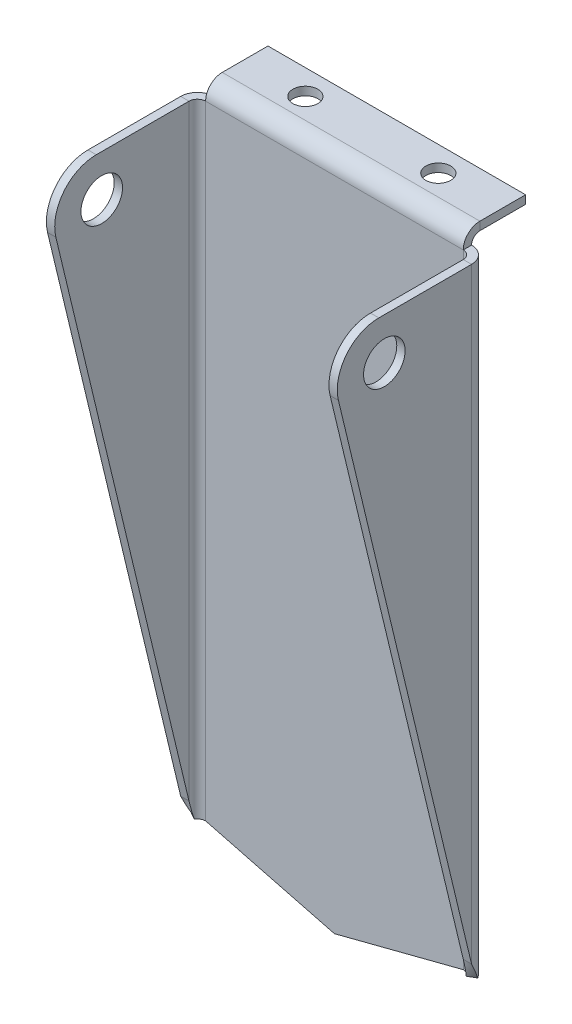
ISO-10303-21;
HEADER;
FILE_DESCRIPTION(('STEP AP214'),'2;1');
FILE_NAME('part.step','',(''),(''),'','','');
FILE_SCHEMA(('AUTOMOTIVE_DESIGN { 1 0 10303 214 1 1 1 1 }'));
ENDSEC;
DATA;
#1=APPLICATION_CONTEXT('core data for automotive mechanical design processes');
#2=APPLICATION_PROTOCOL_DEFINITION('international standard','automotive_design',2000,#1);
#3=PRODUCT_CONTEXT('',#1,'mechanical');
#4=PRODUCT('Part','Part','',(#3));
#5=PRODUCT_RELATED_PRODUCT_CATEGORY('part','',(#4));
#6=PRODUCT_DEFINITION_FORMATION('','',#4);
#7=PRODUCT_DEFINITION_CONTEXT('part definition',#1,'design');
#8=PRODUCT_DEFINITION('design','',#6,#7);
#9=PRODUCT_DEFINITION_SHAPE('','',#8);
#10=(LENGTH_UNIT() NAMED_UNIT(*) SI_UNIT(.MILLI.,.METRE.));
#11=(NAMED_UNIT(*) PLANE_ANGLE_UNIT() SI_UNIT($,.RADIAN.));
#12=(NAMED_UNIT(*) SI_UNIT($,.STERADIAN.) SOLID_ANGLE_UNIT());
#13=UNCERTAINTY_MEASURE_WITH_UNIT(LENGTH_MEASURE(1.E-05),#10,'distance_accuracy_value','');
#14=(GEOMETRIC_REPRESENTATION_CONTEXT(3) GLOBAL_UNCERTAINTY_ASSIGNED_CONTEXT((#13)) GLOBAL_UNIT_ASSIGNED_CONTEXT((#10,
#11,#12)) REPRESENTATION_CONTEXT('',''));
#15=CARTESIAN_POINT('',(0.,0.,0.));
#16=DIRECTION('',(0.,0.,1.));
#17=DIRECTION('',(1.,0.,0.));
#18=AXIS2_PLACEMENT_3D('',#15,#16,#17);
#19=CARTESIAN_POINT('',(-34.9999999999999,-10.0000000000015,-8.68396810574605));
#20=DIRECTION('',(0.999999999999998,0.,0.));
#21=DIRECTION('',(0.,1.,0.));
#22=AXIS2_PLACEMENT_3D('',#19,#20,#21);
#23=CYLINDRICAL_SURFACE('',#22,10.);
#24=DIRECTION('',(-0.999999999999998,0.,0.));
#25=VECTOR('',#24,1.);
#26=CARTESIAN_POINT('',(-34.9999999999999,-12.3337295247532,1.03990491405922));
#27=LINE('',#26,#25);
#28=CARTESIAN_POINT('',(-32.9999999999999,-12.3337295247519,1.03990491405907));
#29=VERTEX_POINT('',#28);
#30=CARTESIAN_POINT('',(-34.9999999999999,-12.3337295247532,1.03990491405922));
#31=VERTEX_POINT('',#30);
#32=EDGE_CURVE('E11',#29,#31,#27,.T.);
#33=ORIENTED_EDGE('',*,*,#32,.F.);
#34=CARTESIAN_POINT('',(-32.9999999999999,-10.0000000000015,-8.68396810574605));
#35=DIRECTION('',(0.999999999999998,0.,0.));
#36=DIRECTION('',(0.,1.,0.));
#37=AXIS2_PLACEMENT_3D('',#34,#35,#36);
#38=CIRCLE('',#37,10.);
#39=CARTESIAN_POINT('',(-32.9999999999999,7.24398594486813E-13,-8.68396810574624));
#40=VERTEX_POINT('',#39);
#41=EDGE_CURVE('E152',#40,#29,#38,.T.);
#42=ORIENTED_EDGE('',*,*,#41,.F.);
#43=DIRECTION('',(-0.999999999999998,0.,0.));
#44=VECTOR('',#43,1.);
#45=CARTESIAN_POINT('',(-34.9999999999999,-6.66133814775094E-13,-8.68396810574604));
#46=LINE('',#45,#44);
#47=CARTESIAN_POINT('',(-34.9999999999999,-6.66133814775094E-13,-8.68396810574604));
#48=VERTEX_POINT('',#47);
#49=EDGE_CURVE('E47',#40,#48,#46,.T.);
#50=ORIENTED_EDGE('',*,*,#49,.T.);
#51=CARTESIAN_POINT('',(-34.9999999999999,-10.0000000000015,-8.68396810574605));
#52=DIRECTION('',(0.999999999999998,0.,0.));
#53=DIRECTION('',(0.,1.,0.));
#54=AXIS2_PLACEMENT_3D('',#51,#52,#53);
#55=CIRCLE('',#54,10.);
#56=EDGE_CURVE('E267',#48,#31,#55,.T.);
#57=ORIENTED_EDGE('',*,*,#56,.T.);
#58=EDGE_LOOP('',(#33,#42,#50,#57));
#59=FACE_BOUND('',#58,.T.);
#60=ADVANCED_FACE('F37',(#59),#23,.T.);
#61=CARTESIAN_POINT('',(-34.9999999999999,0.,31.0000005295282));
#62=DIRECTION('',(0.,1.,0.));
#63=DIRECTION('',(0.,0.,1.));
#64=AXIS2_PLACEMENT_3D('',#61,#62,#63);
#65=PLANE('',#64);
#66=ORIENTED_EDGE('',*,*,#49,.F.);
#67=DIRECTION('',(0.,0.,1.));
#68=VECTOR('',#67,1.);
#69=CARTESIAN_POINT('',(-32.9999999999999,7.21644966006352E-13,31.0000005295281));
#70=LINE('',#69,#68);
#71=CARTESIAN_POINT('',(-32.9999999999999,0.,-31.0000010590563));
#72=VERTEX_POINT('',#71);
#73=EDGE_CURVE('E149',#40,#72,#70,.F.);
#74=ORIENTED_EDGE('',*,*,#73,.T.);
#75=DIRECTION('',(-0.999999999999965,-3.46944695195362E-13,-2.64763984174355E-07));
#76=VECTOR('',#75,1.);
#77=CARTESIAN_POINT('',(-34.9999999999998,-1.33226762955019E-12,-31.000001059056));
#78=LINE('',#77,#76);
#79=CARTESIAN_POINT('',(-34.9999999999998,-1.33226762955019E-12,-31.000001059056));
#80=VERTEX_POINT('',#79);
#81=EDGE_CURVE('E263',#72,#80,#78,.T.);
#82=ORIENTED_EDGE('',*,*,#81,.T.);
#83=DIRECTION('',(0.,0.,1.));
#84=VECTOR('',#83,1.);
#85=CARTESIAN_POINT('',(-34.9999999999999,0.,31.0000005295282));
#86=LINE('',#85,#84);
#87=EDGE_CURVE('E274',#48,#80,#86,.F.);
#88=ORIENTED_EDGE('',*,*,#87,.F.);
#89=EDGE_LOOP('',(#66,#74,#82,#88));
#90=FACE_BOUND('',#89,.T.);
#91=ADVANCED_FACE('F278',(#90),#65,.T.);
#92=CARTESIAN_POINT('',(-30.9999999999999,-7.7715611723761E-13,-31.0000000000001));
#93=DIRECTION('',(0.,-1.,0.));
#94=DIRECTION('',(1.,0.,0.));
#95=AXIS2_PLACEMENT_3D('',#92,#93,#94);
#96=PLANE('',#95);
#97=ORIENTED_EDGE('',*,*,#81,.F.);
#98=CARTESIAN_POINT('',(-30.9999999999999,0.,-31.));
#99=DIRECTION('',(0.,1.,0.));
#100=DIRECTION('',(-1.,0.,0.));
#101=AXIS2_PLACEMENT_3D('',#98,#99,#100);
#102=CIRCLE('',#101,2.00000000000007);
#103=CARTESIAN_POINT('',(-30.9999999999997,1.01298009994998E-12,-33.));
#104=VERTEX_POINT('',#103);
#105=EDGE_CURVE('E145',#72,#104,#102,.F.);
#106=ORIENTED_EDGE('',*,*,#105,.T.);
#107=DIRECTION('',(1.38777878078145E-13,0.,-1.));
#108=VECTOR('',#107,1.);
#109=CARTESIAN_POINT('',(-30.9999999999999,8.88178419700125E-13,-35.));
#110=LINE('',#109,#108);
#111=CARTESIAN_POINT('',(-30.9999999999999,8.88178419700125E-13,-35.));
#112=VERTEX_POINT('',#111);
#113=EDGE_CURVE('E260',#104,#112,#110,.T.);
#114=ORIENTED_EDGE('',*,*,#113,.T.);
#115=CARTESIAN_POINT('',(-30.9999999999999,-7.7715611723761E-13,-31.0000000000001));
#116=DIRECTION('',(0.,1.,0.));
#117=DIRECTION('',(-0.999999999999998,0.,0.));
#118=AXIS2_PLACEMENT_3D('',#115,#116,#117);
#119=CIRCLE('',#118,4.00000000000006);
#120=EDGE_CURVE('E291',#80,#112,#119,.F.);
#121=ORIENTED_EDGE('',*,*,#120,.F.);
#122=EDGE_LOOP('',(#97,#106,#114,#121));
#123=FACE_BOUND('',#122,.T.);
#124=ADVANCED_FACE('F483',(#123),#96,.F.);
#125=CARTESIAN_POINT('',(-30.9999999999999,7.7715611723761E-13,-37.));
#126=DIRECTION('',(-0.999999999999998,0.,0.));
#127=DIRECTION('',(0.,-1.,0.));
#128=AXIS2_PLACEMENT_3D('',#125,#126,#127);
#129=PLANE('',#128);
#130=ORIENTED_EDGE('',*,*,#113,.F.);
#131=CARTESIAN_POINT('',(-30.9999999999997,7.63712146166722E-13,-37.));
#132=DIRECTION('',(0.999999999999998,0.,0.));
#133=DIRECTION('',(0.,1.,0.));
#134=AXIS2_PLACEMENT_3D('',#131,#132,#133);
#135=CIRCLE('',#134,4.);
#136=CARTESIAN_POINT('',(-31.0000000000004,4.00000000000146,-37.0000000000002));
#137=VERTEX_POINT('',#136);
#138=EDGE_CURVE('E196',#104,#137,#135,.F.);
#139=ORIENTED_EDGE('',*,*,#138,.T.);
#140=DIRECTION('',(0.,-1.,0.));
#141=VECTOR('',#140,1.);
#142=CARTESIAN_POINT('',(-30.9999999999999,2.00000000000011,-37.));
#143=LINE('',#142,#141);
#144=CARTESIAN_POINT('',(-30.9999999999999,2.00000000000011,-37.));
#145=VERTEX_POINT('',#144);
#146=EDGE_CURVE('E257',#137,#145,#143,.T.);
#147=ORIENTED_EDGE('',*,*,#146,.T.);
#148=CARTESIAN_POINT('',(-30.9999999999999,7.7715611723761E-13,-37.));
#149=DIRECTION('',(0.999999999999998,0.,0.));
#150=DIRECTION('',(0.,1.,0.));
#151=AXIS2_PLACEMENT_3D('',#148,#149,#150);
#152=CIRCLE('',#151,2.00000000000001);
#153=EDGE_CURVE('E355',#112,#145,#152,.F.);
#154=ORIENTED_EDGE('',*,*,#153,.F.);
#155=EDGE_LOOP('',(#130,#139,#147,#154));
#156=FACE_BOUND('',#155,.T.);
#157=ADVANCED_FACE('F451',(#156),#129,.T.);
#158=CARTESIAN_POINT('',(-30.9999999999999,1.99999999999845,-35.0000000000002));
#159=DIRECTION('',(1.,0.,0.));
#160=DIRECTION('',(0.,0.,1.));
#161=AXIS2_PLACEMENT_3D('',#158,#159,#160);
#162=PLANE('',#161);
#163=ORIENTED_EDGE('',*,*,#146,.F.);
#164=DIRECTION('',(0.,0.,-1.));
#165=VECTOR('',#164,1.);
#166=CARTESIAN_POINT('',(-31.0000000000004,4.00000000000133,0.));
#167=LINE('',#166,#165);
#168=CARTESIAN_POINT('',(-31.0000000000004,4.0000000000015,-48.0000000000004));
#169=VERTEX_POINT('',#168);
#170=EDGE_CURVE('E205',#169,#137,#167,.F.);
#171=ORIENTED_EDGE('',*,*,#170,.F.);
#172=DIRECTION('',(0.,-1.,0.));
#173=VECTOR('',#172,1.);
#174=CARTESIAN_POINT('',(-30.9999999999999,2.00000000000011,-48.0000000000001));
#175=LINE('',#174,#173);
#176=CARTESIAN_POINT('',(-30.9999999999999,2.00000000000011,-48.0000000000001));
#177=VERTEX_POINT('',#176);
#178=EDGE_CURVE('E254',#169,#177,#175,.T.);
#179=ORIENTED_EDGE('',*,*,#178,.T.);
#180=DIRECTION('',(0.,0.,1.));
#181=VECTOR('',#180,1.);
#182=CARTESIAN_POINT('',(-30.9999999999999,1.99999999999845,-35.0000000000002));
#183=LINE('',#182,#181);
#184=EDGE_CURVE('E347',#177,#145,#183,.T.);
#185=ORIENTED_EDGE('',*,*,#184,.T.);
#186=EDGE_LOOP('',(#163,#171,#179,#185));
#187=FACE_BOUND('',#186,.T.);
#188=ADVANCED_FACE('F345',(#187),#162,.F.);
#189=CARTESIAN_POINT('',(-30.9999999999999,2.00000000000011,-48.0000000000001));
#190=DIRECTION('',(0.,0.,1.));
#191=DIRECTION('',(-0.999999999999998,0.,0.));
#192=AXIS2_PLACEMENT_3D('',#189,#190,#191);
#193=PLANE('',#192);
#194=ORIENTED_EDGE('',*,*,#178,.F.);
#195=DIRECTION('',(1.00000000000001,0.,0.));
#196=VECTOR('',#195,1.);
#197=CARTESIAN_POINT('',(0.,4.0000000000015,-48.0000000000004));
#198=LINE('',#197,#196);
#199=CARTESIAN_POINT('',(31.0000000000004,4.0000000000015,-48.0000000000004));
#200=VERTEX_POINT('',#199);
#201=EDGE_CURVE('E202',#200,#169,#198,.F.);
#202=ORIENTED_EDGE('',*,*,#201,.F.);
#203=DIRECTION('',(0.,-1.,0.));
#204=VECTOR('',#203,1.);
#205=CARTESIAN_POINT('',(30.9999999999999,2.00000000000011,-48.0000000000001));
#206=LINE('',#205,#204);
#207=CARTESIAN_POINT('',(30.9999999999999,2.00000000000011,-48.0000000000001));
#208=VERTEX_POINT('',#207);
#209=EDGE_CURVE('E251',#200,#208,#206,.T.);
#210=ORIENTED_EDGE('',*,*,#209,.T.);
#211=DIRECTION('',(-0.999999999999998,0.,0.));
#212=VECTOR('',#211,1.);
#213=CARTESIAN_POINT('',(-30.9999999999999,2.00000000000011,-48.0000000000001));
#214=LINE('',#213,#212);
#215=EDGE_CURVE('E341',#208,#177,#214,.T.);
#216=ORIENTED_EDGE('',*,*,#215,.T.);
#217=EDGE_LOOP('',(#194,#202,#210,#216));
#218=FACE_BOUND('',#217,.T.);
#219=ADVANCED_FACE('F336',(#218),#193,.F.);
#220=CARTESIAN_POINT('',(30.9999999999999,2.00000000000011,-48.0000000000001));
#221=DIRECTION('',(-1.,0.,0.));
#222=DIRECTION('',(0.,0.,-1.));
#223=AXIS2_PLACEMENT_3D('',#220,#221,#222);
#224=PLANE('',#223);
#225=ORIENTED_EDGE('',*,*,#209,.F.);
#226=DIRECTION('',(0.,0.,-1.));
#227=VECTOR('',#226,1.);
#228=CARTESIAN_POINT('',(31.0000000000004,4.00000000000133,0.));
#229=LINE('',#228,#227);
#230=CARTESIAN_POINT('',(31.0000000000004,4.00000000000146,-37.0000000000002));
#231=VERTEX_POINT('',#230);
#232=EDGE_CURVE('E197',#231,#200,#229,.T.);
#233=ORIENTED_EDGE('',*,*,#232,.F.);
#234=DIRECTION('',(0.,-1.,0.));
#235=VECTOR('',#234,1.);
#236=CARTESIAN_POINT('',(30.9999999999999,2.00000000000011,-37.));
#237=LINE('',#236,#235);
#238=CARTESIAN_POINT('',(30.9999999999999,2.00000000000011,-37.));
#239=VERTEX_POINT('',#238);
#240=EDGE_CURVE('E248',#231,#239,#237,.T.);
#241=ORIENTED_EDGE('',*,*,#240,.T.);
#242=DIRECTION('',(0.,0.,-1.));
#243=VECTOR('',#242,1.);
#244=CARTESIAN_POINT('',(30.9999999999999,2.00000000000011,-48.0000000000001));
#245=LINE('',#244,#243);
#246=EDGE_CURVE('E357',#239,#208,#245,.T.);
#247=ORIENTED_EDGE('',*,*,#246,.T.);
#248=EDGE_LOOP('',(#225,#233,#241,#247));
#249=FACE_BOUND('',#248,.T.);
#250=ADVANCED_FACE('F327',(#249),#224,.F.);
#251=CARTESIAN_POINT('',(30.9999999999999,7.7715611723761E-13,-37.));
#252=DIRECTION('',(-0.999999999999998,0.,0.));
#253=DIRECTION('',(0.,-1.,0.));
#254=AXIS2_PLACEMENT_3D('',#251,#252,#253);
#255=PLANE('',#254);
#256=ORIENTED_EDGE('',*,*,#240,.F.);
#257=CARTESIAN_POINT('',(30.9999999999999,7.7715611723761E-13,-37.));
#258=DIRECTION('',(0.999999999999998,0.,0.));
#259=DIRECTION('',(0.,1.,0.));
#260=AXIS2_PLACEMENT_3D('',#257,#258,#259);
#261=CIRCLE('',#260,4.);
#262=CARTESIAN_POINT('',(30.9999999999997,9.43689570931383E-13,-33.));
#263=VERTEX_POINT('',#262);
#264=EDGE_CURVE('E193',#231,#263,#261,.T.);
#265=ORIENTED_EDGE('',*,*,#264,.T.);
#266=DIRECTION('',(0.,-3.46944695195364E-13,-1.));
#267=VECTOR('',#266,1.);
#268=CARTESIAN_POINT('',(30.9999999999999,8.88178419700125E-13,-35.));
#269=LINE('',#268,#267);
#270=CARTESIAN_POINT('',(30.9999999999999,8.88178419700125E-13,-35.));
#271=VERTEX_POINT('',#270);
#272=EDGE_CURVE('E245',#263,#271,#269,.T.);
#273=ORIENTED_EDGE('',*,*,#272,.T.);
#274=CARTESIAN_POINT('',(30.9999999999999,7.7715611723761E-13,-37.));
#275=DIRECTION('',(0.999999999999998,0.,0.));
#276=DIRECTION('',(0.,1.,0.));
#277=AXIS2_PLACEMENT_3D('',#274,#275,#276);
#278=CIRCLE('',#277,2.00000000000001);
#279=EDGE_CURVE('E363',#239,#271,#278,.T.);
#280=ORIENTED_EDGE('',*,*,#279,.F.);
#281=EDGE_LOOP('',(#256,#265,#273,#280));
#282=FACE_BOUND('',#281,.T.);
#283=ADVANCED_FACE('F318',(#282),#255,.F.);
#284=CARTESIAN_POINT('',(30.9999999999999,-7.7715611723761E-13,-31.0000000000001));
#285=DIRECTION('',(0.,-1.,0.));
#286=DIRECTION('',(1.,0.,0.));
#287=AXIS2_PLACEMENT_3D('',#284,#285,#286);
#288=PLANE('',#287);
#289=ORIENTED_EDGE('',*,*,#272,.F.);
#290=CARTESIAN_POINT('',(30.9999999999999,2.27595720048157E-12,-31.));
#291=DIRECTION('',(0.,1.,0.));
#292=DIRECTION('',(-1.,0.,0.));
#293=AXIS2_PLACEMENT_3D('',#290,#291,#292);
#294=CIRCLE('',#293,2.00000000000005);
#295=CARTESIAN_POINT('',(32.9999999999999,1.39208089507535E-12,-31.0000005295284));
#296=VERTEX_POINT('',#295);
#297=EDGE_CURVE('E176',#263,#296,#294,.F.);
#298=ORIENTED_EDGE('',*,*,#297,.T.);
#299=DIRECTION('',(0.999999999999998,0.,0.));
#300=VECTOR('',#299,1.);
#301=CARTESIAN_POINT('',(34.9999999999999,0.,-31.0000005295281));
#302=LINE('',#301,#300);
#303=CARTESIAN_POINT('',(34.9999999999999,0.,-31.0000005295281));
#304=VERTEX_POINT('',#303);
#305=EDGE_CURVE('E242',#296,#304,#302,.T.);
#306=ORIENTED_EDGE('',*,*,#305,.T.);
#307=CARTESIAN_POINT('',(30.9999999999999,-7.7715611723761E-13,-31.0000000000001));
#308=DIRECTION('',(0.,1.,0.));
#309=DIRECTION('',(-0.999999999999998,0.,0.));
#310=AXIS2_PLACEMENT_3D('',#307,#308,#309);
#311=CIRCLE('',#310,4.00000000000004);
#312=EDGE_CURVE('E285',#271,#304,#311,.F.);
#313=ORIENTED_EDGE('',*,*,#312,.F.);
#314=EDGE_LOOP('',(#289,#298,#306,#313));
#315=FACE_BOUND('',#314,.T.);
#316=ADVANCED_FACE('F553',(#315),#288,.F.);
#317=CARTESIAN_POINT('',(34.9999999999999,0.,31.0000005295282));
#318=DIRECTION('',(0.,-1.,0.));
#319=DIRECTION('',(0.,0.,1.));
#320=AXIS2_PLACEMENT_3D('',#317,#318,#319);
#321=PLANE('',#320);
#322=ORIENTED_EDGE('',*,*,#305,.F.);
#323=DIRECTION('',(0.,0.,1.));
#324=VECTOR('',#323,1.);
#325=CARTESIAN_POINT('',(32.9999999999999,1.38777878078145E-12,31.0000005295282));
#326=LINE('',#325,#324);
#327=CARTESIAN_POINT('',(32.9999999999999,7.24398594486813E-13,-8.68396810574624));
#328=VERTEX_POINT('',#327);
#329=EDGE_CURVE('E187',#296,#328,#326,.T.);
#330=ORIENTED_EDGE('',*,*,#329,.T.);
#331=DIRECTION('',(0.999999999999998,0.,0.));
#332=VECTOR('',#331,1.);
#333=CARTESIAN_POINT('',(34.9999999999999,-6.66133814775094E-13,-8.68396810574604));
#334=LINE('',#333,#332);
#335=CARTESIAN_POINT('',(34.9999999999999,-6.66133814775094E-13,-8.68396810574604));
#336=VERTEX_POINT('',#335);
#337=EDGE_CURVE('E239',#328,#336,#334,.T.);
#338=ORIENTED_EDGE('',*,*,#337,.T.);
#339=DIRECTION('',(0.,0.,1.));
#340=VECTOR('',#339,1.);
#341=CARTESIAN_POINT('',(34.9999999999999,0.,31.0000005295282));
#342=LINE('',#341,#340);
#343=EDGE_CURVE('E374',#304,#336,#342,.T.);
#344=ORIENTED_EDGE('',*,*,#343,.F.);
#345=EDGE_LOOP('',(#322,#330,#338,#344));
#346=FACE_BOUND('',#345,.T.);
#347=ADVANCED_FACE('F401',(#346),#321,.F.);
#348=CARTESIAN_POINT('',(34.9999999999999,-10.0000000000013,-8.68396810574602));
#349=DIRECTION('',(-0.999999999999998,0.,0.));
#350=DIRECTION('',(0.,-1.,0.));
#351=AXIS2_PLACEMENT_3D('',#348,#349,#350);
#352=CYLINDRICAL_SURFACE('',#351,10.);
#353=ORIENTED_EDGE('',*,*,#337,.F.);
#354=CARTESIAN_POINT('',(32.9999999999999,-10.0000000000013,-8.68396810574602));
#355=DIRECTION('',(-0.999999999999998,0.,0.));
#356=DIRECTION('',(0.,-1.,0.));
#357=AXIS2_PLACEMENT_3D('',#354,#355,#356);
#358=CIRCLE('',#357,10.);
#359=CARTESIAN_POINT('',(32.9999999999999,-12.3337295247519,1.03990491405907));
#360=VERTEX_POINT('',#359);
#361=EDGE_CURVE('E180',#360,#328,#358,.T.);
#362=ORIENTED_EDGE('',*,*,#361,.F.);
#363=DIRECTION('',(0.999999999999998,0.,0.));
#364=VECTOR('',#363,1.);
#365=CARTESIAN_POINT('',(34.9999999999999,-12.3337295247532,1.03990491405922));
#366=LINE('',#365,#364);
#367=CARTESIAN_POINT('',(34.9999999999999,-12.3337295247532,1.03990491405922));
#368=VERTEX_POINT('',#367);
#369=EDGE_CURVE('E236',#360,#368,#366,.T.);
#370=ORIENTED_EDGE('',*,*,#369,.T.);
#371=CARTESIAN_POINT('',(34.9999999999999,-10.0000000000013,-8.68396810574602));
#372=DIRECTION('',(-0.999999999999998,0.,0.));
#373=DIRECTION('',(0.,-1.,0.));
#374=AXIS2_PLACEMENT_3D('',#371,#372,#373);
#375=CIRCLE('',#374,10.);
#376=EDGE_CURVE('E377',#368,#336,#375,.T.);
#377=ORIENTED_EDGE('',*,*,#376,.T.);
#378=EDGE_LOOP('',(#353,#362,#370,#377));
#379=FACE_BOUND('',#378,.T.);
#380=ADVANCED_FACE('F463',(#379),#352,.T.);
#381=CARTESIAN_POINT('',(34.9999999999999,-135.703479456235,-28.5688350694963));
#382=DIRECTION('',(0.,0.233372952475324,-0.972387301980518));
#383=DIRECTION('',(0.,-0.972387301980524,-0.233372952475325));
#384=AXIS2_PLACEMENT_3D('',#381,#382,#383);
#385=PLANE('',#384);
#386=ORIENTED_EDGE('',*,*,#369,.F.);
#387=DIRECTION('',(0.,-0.972387301980524,-0.233372952475325));
#388=VECTOR('',#387,1.);
#389=CARTESIAN_POINT('',(32.9999999999999,-135.703479456235,-28.5688350694963));
#390=LINE('',#389,#388);
#391=CARTESIAN_POINT('',(32.9999999999999,-145.833335539701,-31.0000010590564));
#392=VERTEX_POINT('',#391);
#393=EDGE_CURVE('E181',#360,#392,#390,.T.);
#394=ORIENTED_EDGE('',*,*,#393,.T.);
#395=DIRECTION('',(0.999999999999965,0.,-2.6476400593068E-07));
#396=VECTOR('',#395,1.);
#397=CARTESIAN_POINT('',(34.9999999999998,-145.833335539701,-31.0000010590561));
#398=LINE('',#397,#396);
#399=CARTESIAN_POINT('',(34.9999999999998,-145.833335539701,-31.0000010590561));
#400=VERTEX_POINT('',#399);
#401=EDGE_CURVE('E233',#392,#400,#398,.T.);
#402=ORIENTED_EDGE('',*,*,#401,.T.);
#403=DIRECTION('',(0.,-0.972387301980524,-0.233372952475325));
#404=VECTOR('',#403,1.);
#405=CARTESIAN_POINT('',(34.9999999999999,-135.703479456235,-28.5688350694963));
#406=LINE('',#405,#404);
#407=EDGE_CURVE('E368',#368,#400,#406,.T.);
#408=ORIENTED_EDGE('',*,*,#407,.F.);
#409=EDGE_LOOP('',(#386,#394,#402,#408));
#410=FACE_BOUND('',#409,.T.);
#411=ADVANCED_FACE('F465',(#410),#385,.F.);
#412=CARTESIAN_POINT('',(30.9999999999999,-137.500000000001,-29.));
#413=CARTESIAN_POINT('',(30.9999999999999,-137.500000000001,-28.3333333333334));
#414=CARTESIAN_POINT('',(31.,-137.500000000001,-27.6666666666667));
#415=CARTESIAN_POINT('',(30.9999999999999,-137.500000000001,-27.0000000000001));
#416=CARTESIAN_POINT('',(35.0000000000001,-137.500000000001,-29.));
#417=CARTESIAN_POINT('',(36.3333333333334,-137.500000000001,-28.3333333333334));
#418=CARTESIAN_POINT('',(37.6666666666668,-137.500000000001,-27.6666666666667));
#419=CARTESIAN_POINT('',(39.0000000000001,-137.500000000001,-27.0000000000001));
#420=CARTESIAN_POINT('',(35.0000000000001,-154.166666666668,-33.0000000000001));
#421=CARTESIAN_POINT('',(36.3333333333334,-154.166666666668,-33.6666666666668));
#422=CARTESIAN_POINT('',(37.6666666666668,-154.166666666668,-34.3333333333335));
#423=CARTESIAN_POINT('',(39.0000000000001,-154.166666666668,-35.0000000000001));
#424=CARTESIAN_POINT('',(30.9999999999999,-154.166666666668,-33.0000000000001));
#425=CARTESIAN_POINT('',(30.9999999999999,-154.166666666668,-33.6666666666668));
#426=CARTESIAN_POINT('',(31.,-154.166666666668,-34.3333333333335));
#427=CARTESIAN_POINT('',(30.9999999999999,-154.166666666668,-35.0000000000001));
#428=CARTESIAN_POINT('',(26.9999999999998,-154.166666666668,-33.0000000000001));
#429=CARTESIAN_POINT('',(25.6666666666665,-154.166666666668,-33.6666666666668));
#430=CARTESIAN_POINT('',(24.3333333333331,-154.166666666668,-34.3333333333335));
#431=CARTESIAN_POINT('',(22.9999999999998,-154.166666666668,-35.0000000000001));
#432=CARTESIAN_POINT('',(26.9999999999998,-137.500000000001,-29.));
#433=CARTESIAN_POINT('',(25.6666666666665,-137.500000000001,-28.3333333333334));
#434=CARTESIAN_POINT('',(24.3333333333331,-137.500000000001,-27.6666666666667));
#435=CARTESIAN_POINT('',(22.9999999999998,-137.500000000001,-27.0000000000001));
#436=CARTESIAN_POINT('',(30.9999999999999,-137.500000000001,-29.));
#437=CARTESIAN_POINT('',(30.9999999999999,-137.500000000001,-28.3333333333334));
#438=CARTESIAN_POINT('',(31.,-137.500000000001,-27.6666666666667));
#439=CARTESIAN_POINT('',(30.9999999999999,-137.500000000001,-27.0000000000001));
#440=(BOUNDED_SURFACE() B_SPLINE_SURFACE(3,3,((#412,#413,#414,#415),(#416,#417,#418,#419),(#420,
#421,#422,#423),(#424,#425,#426,#427),(#428,#429,#430,#431),(#432,#433,#434,#435),(#436,#437,
#438,#439)),.UNSPECIFIED.,.T.,.F.,.F.) B_SPLINE_SURFACE_WITH_KNOTS((4,3,4),(4,4),(0.,0.5,1.),
(0.,1.),.UNSPECIFIED.) GEOMETRIC_REPRESENTATION_ITEM() RATIONAL_B_SPLINE_SURFACE(((1.,1.,1.,1.),
(0.333333333333333,0.333333333333333,0.333333333333333,0.333333333333333),(0.333333333333333,
0.333333333333333,0.333333333333333,0.333333333333333),(1.,1.,1.,1.),(0.333333333333333,
0.333333333333333,0.333333333333333,0.333333333333333),(0.333333333333333,0.333333333333333,
0.333333333333333,0.333333333333333),(1.,1.,1.,1.))) REPRESENTATION_ITEM('') SURFACE());
#441=CARTESIAN_POINT('',(30.9999999999999,-145.833333333335,-31.0000000000001));
#442=DIRECTION('',(0.,0.233372952475326,-0.972387301980527));
#443=DIRECTION('',(0.,0.972387301980518,0.233372952475323));
#444=AXIS2_PLACEMENT_3D('',#441,#442,#443);
#445=ELLIPSE('',#444,8.56997342145521,2.00000000000005);
#446=CARTESIAN_POINT('',(32.7320508075689,-150.,-32.0000000000001));
#447=VERTEX_POINT('',#446);
#448=EDGE_CURVE('E177',#392,#447,#445,.T.);
#449=DIRECTION('',(0.866025403784438,0.,-0.500000000000002));
#450=VECTOR('',#449,1.);
#451=CARTESIAN_POINT('',(34.4641016151377,-150.,-33.));
#452=LINE('',#451,#450);
#453=CARTESIAN_POINT('',(34.4641016151377,-150.,-33.));
#454=VERTEX_POINT('',#453);
#455=EDGE_CURVE('E230',#447,#454,#452,.T.);
#456=CARTESIAN_POINT('',(30.9999999999999,-145.833333333335,-31.0000000000001));
#457=DIRECTION('',(0.,0.432731067584771,-0.901523057468279));
#458=DIRECTION('',(0.,0.901523057468281,0.43273106758477));
#459=AXIS2_PLACEMENT_3D('',#456,#457,#458);
#460=ELLIPSE('',#459,9.2436164159082,4.00000000000004);
#461=EDGE_CURVE('E380',#400,#454,#460,.T.);
#462=ORIENTED_EDGE('',*,*,#401,.F.);
#463=ORIENTED_EDGE('',*,*,#448,.T.);
#464=ORIENTED_EDGE('',*,*,#455,.T.);
#465=ORIENTED_EDGE('',*,*,#461,.F.);
#466=EDGE_LOOP('',(#462,#463,#464,#465));
#467=FACE_BOUND('',#466,.T.);
#468=ADVANCED_FACE('F411',(#467),#440,.T.);
#469=CARTESIAN_POINT('',(30.9999999999999,-150.000000000001,-31.0000000000001));
#470=DIRECTION('',(0.,-1.,0.));
#471=DIRECTION('',(1.,0.,0.));
#472=AXIS2_PLACEMENT_3D('',#469,#470,#471);
#473=PLANE('',#472);
#474=ORIENTED_EDGE('',*,*,#455,.F.);
#475=CARTESIAN_POINT('',(30.9999999999999,-150.000000000001,-31.0000000000001));
#476=DIRECTION('',(0.,1.,0.));
#477=DIRECTION('',(-1.,0.,0.));
#478=AXIS2_PLACEMENT_3D('',#475,#476,#477);
#479=CIRCLE('',#478,2.00000000000005);
#480=CARTESIAN_POINT('',(30.9999999999997,-150.000000000001,-33.));
#481=VERTEX_POINT('',#480);
#482=EDGE_CURVE('E173',#481,#447,#479,.F.);
#483=ORIENTED_EDGE('',*,*,#482,.F.);
#484=DIRECTION('',(0.,0.,-1.));
#485=VECTOR('',#484,1.);
#486=CARTESIAN_POINT('',(31.,-150.000000000001,-35.));
#487=LINE('',#486,#485);
#488=CARTESIAN_POINT('',(31.,-150.000000000001,-35.));
#489=VERTEX_POINT('',#488);
#490=EDGE_CURVE('E227',#481,#489,#487,.T.);
#491=ORIENTED_EDGE('',*,*,#490,.T.);
#492=CARTESIAN_POINT('',(30.9999999999999,-150.000000000001,-31.0000000000001));
#493=DIRECTION('',(0.,1.,0.));
#494=DIRECTION('',(-0.999999999999998,0.,0.));
#495=AXIS2_PLACEMENT_3D('',#492,#493,#494);
#496=CIRCLE('',#495,4.00000000000004);
#497=EDGE_CURVE('E383',#489,#454,#496,.F.);
#498=ORIENTED_EDGE('',*,*,#497,.T.);
#499=EDGE_LOOP('',(#474,#483,#491,#498));
#500=FACE_BOUND('',#499,.T.);
#501=ADVANCED_FACE('F417',(#500),#473,.T.);
#502=CARTESIAN_POINT('',(31.,-150.000000000001,-35.));
#503=DIRECTION('',(0.249878019021772,-0.968277323709357,0.));
#504=DIRECTION('',(0.968277323709356,0.249878019021771,0.));
#505=AXIS2_PLACEMENT_3D('',#502,#503,#504);
#506=PLANE('',#505);
#507=ORIENTED_EDGE('',*,*,#490,.F.);
#508=DIRECTION('',(0.968277323709356,0.249878019021771,0.));
#509=VECTOR('',#508,1.);
#510=CARTESIAN_POINT('',(31.,-150.000000000001,-33.));
#511=LINE('',#510,#509);
#512=CARTESIAN_POINT('',(-1.38777895609491E-13,-158.000000000001,-33.));
#513=VERTEX_POINT('',#512);
#514=EDGE_CURVE('E169',#513,#481,#511,.T.);
#515=ORIENTED_EDGE('',*,*,#514,.F.);
#516=DIRECTION('',(0.,0.,-1.));
#517=VECTOR('',#516,1.);
#518=CARTESIAN_POINT('',(0.,-158.000000000001,-35.0000000000001));
#519=LINE('',#518,#517);
#520=CARTESIAN_POINT('',(0.,-158.000000000001,-35.0000000000001));
#521=VERTEX_POINT('',#520);
#522=EDGE_CURVE('E224',#513,#521,#519,.T.);
#523=ORIENTED_EDGE('',*,*,#522,.T.);
#524=DIRECTION('',(0.968277323709356,0.249878019021771,0.));
#525=VECTOR('',#524,1.);
#526=CARTESIAN_POINT('',(31.,-150.000000000001,-35.));
#527=LINE('',#526,#525);
#528=EDGE_CURVE('E423',#521,#489,#527,.T.);
#529=ORIENTED_EDGE('',*,*,#528,.T.);
#530=EDGE_LOOP('',(#507,#515,#523,#529));
#531=FACE_BOUND('',#530,.T.);
#532=ADVANCED_FACE('F421',(#531),#506,.T.);
#533=CARTESIAN_POINT('',(0.,-158.000000000001,-35.0000000000001));
#534=DIRECTION('',(-0.249878019021772,-0.968277323709357,0.));
#535=DIRECTION('',(0.968277323709355,-0.249878019021772,0.));
#536=AXIS2_PLACEMENT_3D('',#533,#534,#535);
#537=PLANE('',#536);
#538=ORIENTED_EDGE('',*,*,#522,.F.);
#539=DIRECTION('',(0.968277323709355,-0.249878019021772,0.));
#540=VECTOR('',#539,1.);
#541=CARTESIAN_POINT('',(0.,-158.000000000001,-33.0000000000001));
#542=LINE('',#541,#540);
#543=CARTESIAN_POINT('',(-30.9999999999999,-150.000000000001,-33.));
#544=VERTEX_POINT('',#543);
#545=EDGE_CURVE('E165',#544,#513,#542,.T.);
#546=ORIENTED_EDGE('',*,*,#545,.F.);
#547=DIRECTION('',(0.,0.,-1.));
#548=VECTOR('',#547,1.);
#549=CARTESIAN_POINT('',(-30.9999999999999,-150.000000000001,-35.));
#550=LINE('',#549,#548);
#551=CARTESIAN_POINT('',(-30.9999999999999,-150.000000000001,-35.));
#552=VERTEX_POINT('',#551);
#553=EDGE_CURVE('E221',#544,#552,#550,.T.);
#554=ORIENTED_EDGE('',*,*,#553,.T.);
#555=DIRECTION('',(0.968277323709355,-0.249878019021772,0.));
#556=VECTOR('',#555,1.);
#557=CARTESIAN_POINT('',(0.,-158.000000000001,-35.0000000000001));
#558=LINE('',#557,#556);
#559=EDGE_CURVE('E427',#552,#521,#558,.T.);
#560=ORIENTED_EDGE('',*,*,#559,.T.);
#561=EDGE_LOOP('',(#538,#546,#554,#560));
#562=FACE_BOUND('',#561,.T.);
#563=ADVANCED_FACE('F530',(#562),#537,.T.);
#564=CARTESIAN_POINT('',(-30.9999999999999,-150.000000000001,-31.0000000000001));
#565=DIRECTION('',(0.,-1.,0.));
#566=DIRECTION('',(1.,0.,0.));
#567=AXIS2_PLACEMENT_3D('',#564,#565,#566);
#568=PLANE('',#567);
#569=ORIENTED_EDGE('',*,*,#553,.F.);
#570=CARTESIAN_POINT('',(-30.9999999999999,-150.,-31.0000000000001));
#571=DIRECTION('',(0.,1.,0.));
#572=DIRECTION('',(-1.,0.,0.));
#573=AXIS2_PLACEMENT_3D('',#570,#571,#572);
#574=CIRCLE('',#573,2.00000000000007);
#575=CARTESIAN_POINT('',(-32.7320508075688,-150.,-32.0000000000001));
#576=VERTEX_POINT('',#575);
#577=EDGE_CURVE('E156',#576,#544,#574,.F.);
#578=ORIENTED_EDGE('',*,*,#577,.F.);
#579=DIRECTION('',(-0.866025403784439,0.,-0.499999999999999));
#580=VECTOR('',#579,1.);
#581=CARTESIAN_POINT('',(-34.4641016151376,-150.,-33.));
#582=LINE('',#581,#580);
#583=CARTESIAN_POINT('',(-34.4641016151376,-150.,-33.));
#584=VERTEX_POINT('',#583);
#585=EDGE_CURVE('E55',#576,#584,#582,.T.);
#586=ORIENTED_EDGE('',*,*,#585,.T.);
#587=CARTESIAN_POINT('',(-30.9999999999999,-150.000000000001,-31.0000000000001));
#588=DIRECTION('',(0.,1.,0.));
#589=DIRECTION('',(-0.999999999999998,0.,0.));
#590=AXIS2_PLACEMENT_3D('',#587,#588,#589);
#591=CIRCLE('',#590,4.00000000000006);
#592=EDGE_CURVE('E134',#584,#552,#591,.F.);
#593=ORIENTED_EDGE('',*,*,#592,.T.);
#594=EDGE_LOOP('',(#569,#578,#586,#593));
#595=FACE_BOUND('',#594,.T.);
#596=ADVANCED_FACE('F505',(#595),#568,.T.);
#597=CARTESIAN_POINT('',(-30.9999999999999,-137.500000000001,-29.));
#598=CARTESIAN_POINT('',(-30.9999999999999,-137.500000000001,-28.3333333333334));
#599=CARTESIAN_POINT('',(-30.9999999999999,-137.500000000001,-27.6666666666667));
#600=CARTESIAN_POINT('',(-30.9999999999999,-137.500000000001,-27.));
#601=CARTESIAN_POINT('',(-26.9999999999997,-137.500000000001,-29.));
#602=CARTESIAN_POINT('',(-25.6666666666664,-137.500000000001,-28.3333333333334));
#603=CARTESIAN_POINT('',(-24.333333333333,-137.500000000001,-27.6666666666667));
#604=CARTESIAN_POINT('',(-22.9999999999997,-137.500000000001,-27.));
#605=CARTESIAN_POINT('',(-26.9999999999997,-154.166666666669,-33.0000000000002));
#606=CARTESIAN_POINT('',(-25.6666666666664,-154.166666666669,-33.6666666666668));
#607=CARTESIAN_POINT('',(-24.333333333333,-154.166666666669,-34.3333333333335));
#608=CARTESIAN_POINT('',(-22.9999999999997,-154.166666666668,-35.0000000000002));
#609=CARTESIAN_POINT('',(-30.9999999999999,-154.166666666669,-33.0000000000002));
#610=CARTESIAN_POINT('',(-30.9999999999999,-154.166666666668,-33.6666666666668));
#611=CARTESIAN_POINT('',(-30.9999999999999,-154.166666666668,-34.3333333333335));
#612=CARTESIAN_POINT('',(-30.9999999999999,-154.166666666668,-35.0000000000002));
#613=CARTESIAN_POINT('',(-35.0000000000001,-154.166666666669,-33.0000000000002));
#614=CARTESIAN_POINT('',(-36.3333333333334,-154.166666666669,-33.6666666666668));
#615=CARTESIAN_POINT('',(-37.6666666666668,-154.166666666669,-34.3333333333335));
#616=CARTESIAN_POINT('',(-39.0000000000001,-154.166666666668,-35.0000000000002));
#617=CARTESIAN_POINT('',(-35.0000000000001,-137.500000000001,-29.));
#618=CARTESIAN_POINT('',(-36.3333333333334,-137.500000000001,-28.3333333333334));
#619=CARTESIAN_POINT('',(-37.6666666666668,-137.500000000001,-27.6666666666667));
#620=CARTESIAN_POINT('',(-39.0000000000001,-137.500000000001,-27.));
#621=CARTESIAN_POINT('',(-30.9999999999999,-137.500000000001,-29.));
#622=CARTESIAN_POINT('',(-30.9999999999999,-137.500000000001,-28.3333333333334));
#623=CARTESIAN_POINT('',(-30.9999999999999,-137.500000000001,-27.6666666666667));
#624=CARTESIAN_POINT('',(-30.9999999999999,-137.500000000001,-27.));
#625=(BOUNDED_SURFACE() B_SPLINE_SURFACE(3,3,((#597,#598,#599,#600),(#601,#602,#603,#604),(#605,
#606,#607,#608),(#609,#610,#611,#612),(#613,#614,#615,#616),(#617,#618,#619,#620),(#621,#622,
#623,#624)),.UNSPECIFIED.,.T.,.F.,.F.) B_SPLINE_SURFACE_WITH_KNOTS((4,3,4),(4,4),(0.,0.5,1.),
(0.,1.),.UNSPECIFIED.) GEOMETRIC_REPRESENTATION_ITEM() RATIONAL_B_SPLINE_SURFACE(((1.,1.,1.,1.),
(0.333333333333333,0.333333333333333,0.333333333333333,0.333333333333333),(0.333333333333333,
0.333333333333333,0.333333333333333,0.333333333333333),(1.,1.,1.,1.),(0.333333333333333,
0.333333333333333,0.333333333333333,0.333333333333333),(0.333333333333333,0.333333333333333,
0.333333333333333,0.333333333333333),(1.,1.,1.,1.))) REPRESENTATION_ITEM('') SURFACE());
#626=CARTESIAN_POINT('',(-30.9999999999999,-145.833333333335,-31.0000000000001));
#627=DIRECTION('',(0.,0.233372952475325,-0.972387301980527));
#628=DIRECTION('',(0.,0.972387301980518,0.233372952475323));
#629=AXIS2_PLACEMENT_3D('',#626,#627,#628);
#630=ELLIPSE('',#629,8.56997342145532,2.00000000000007);
#631=CARTESIAN_POINT('',(-32.9999999999999,-145.833335539701,-31.0000005295284));
#632=VERTEX_POINT('',#631);
#633=EDGE_CURVE('E142',#576,#632,#630,.T.);
#634=DIRECTION('',(-0.999999999999998,0.,0.));
#635=VECTOR('',#634,1.);
#636=CARTESIAN_POINT('',(-34.9999999999998,-145.833335539701,-31.0000005295281));
#637=LINE('',#636,#635);
#638=CARTESIAN_POINT('',(-34.9999999999998,-145.833335539701,-31.0000005295281));
#639=VERTEX_POINT('',#638);
#640=EDGE_CURVE('E41',#632,#639,#637,.T.);
#641=CARTESIAN_POINT('',(-30.9999999999999,-145.833333333335,-31.0000000000001));
#642=DIRECTION('',(0.,0.432731067584768,-0.90152305746828));
#643=DIRECTION('',(0.,0.901523057468282,0.432731067584767));
#644=AXIS2_PLACEMENT_3D('',#641,#642,#643);
#645=ELLIPSE('',#644,9.24361641590831,4.00000000000006);
#646=EDGE_CURVE('E276',#584,#639,#645,.T.);
#647=ORIENTED_EDGE('',*,*,#585,.F.);
#648=ORIENTED_EDGE('',*,*,#633,.T.);
#649=ORIENTED_EDGE('',*,*,#640,.T.);
#650=ORIENTED_EDGE('',*,*,#646,.F.);
#651=EDGE_LOOP('',(#647,#648,#649,#650));
#652=FACE_BOUND('',#651,.T.);
#653=ADVANCED_FACE('F154',(#652),#625,.T.);
#654=CARTESIAN_POINT('',(-15.9999999999999,2.,-42.));
#655=DIRECTION('',(0.,-1.,0.));
#656=DIRECTION('',(0.,0.,-1.));
#657=AXIS2_PLACEMENT_3D('',#654,#655,#656);
#658=CYLINDRICAL_SURFACE('',#657,3.);
#659=CARTESIAN_POINT('',(-15.9999999999999,2.,-42.));
#660=DIRECTION('',(0.,1.,0.));
#661=DIRECTION('',(0.,0.,-1.));
#662=AXIS2_PLACEMENT_3D('',#659,#660,#661);
#663=CIRCLE('',#662,3.);
#664=CARTESIAN_POINT('',(-15.9999999999999,2.00000000000001,-45.));
#665=VERTEX_POINT('',#664);
#666=EDGE_CURVE('E438',#665,#665,#663,.T.);
#667=ORIENTED_EDGE('',*,*,#666,.F.);
#668=EDGE_LOOP('',(#667));
#669=FACE_BOUND('',#668,.T.);
#670=CARTESIAN_POINT('',(-15.9999999999999,4.00000000000002,-42.));
#671=DIRECTION('',(0.,1.,0.));
#672=DIRECTION('',(0.,0.,1.));
#673=AXIS2_PLACEMENT_3D('',#670,#671,#672);
#674=CIRCLE('',#673,3.);
#675=CARTESIAN_POINT('',(-15.9999999999999,4.00000000000001,-39.));
#676=VERTEX_POINT('',#675);
#677=EDGE_CURVE('E215',#676,#676,#674,.T.);
#678=ORIENTED_EDGE('',*,*,#677,.T.);
#679=EDGE_LOOP('',(#678));
#680=FACE_BOUND('',#679,.T.);
#681=ADVANCED_FACE('F497',(#669,#680),#658,.F.);
#682=CARTESIAN_POINT('',(15.9999999999999,2.,-42.));
#683=DIRECTION('',(0.,-1.,0.));
#684=DIRECTION('',(0.,0.,-1.));
#685=AXIS2_PLACEMENT_3D('',#682,#683,#684);
#686=CYLINDRICAL_SURFACE('',#685,3.);
#687=CARTESIAN_POINT('',(15.9999999999999,2.,-42.));
#688=DIRECTION('',(0.,-1.,0.));
#689=DIRECTION('',(0.,0.,-1.));
#690=AXIS2_PLACEMENT_3D('',#687,#688,#689);
#691=CIRCLE('',#690,3.);
#692=CARTESIAN_POINT('',(15.9999999999999,2.00000000000001,-45.));
#693=VERTEX_POINT('',#692);
#694=EDGE_CURVE('E441',#693,#693,#691,.T.);
#695=ORIENTED_EDGE('',*,*,#694,.T.);
#696=EDGE_LOOP('',(#695));
#697=FACE_BOUND('',#696,.T.);
#698=CARTESIAN_POINT('',(15.9999999999999,4.00000000000002,-42.));
#699=DIRECTION('',(0.,-1.,0.));
#700=DIRECTION('',(0.,0.,-1.));
#701=AXIS2_PLACEMENT_3D('',#698,#699,#700);
#702=CIRCLE('',#701,3.);
#703=CARTESIAN_POINT('',(15.9999999999999,4.00000000000003,-45.));
#704=VERTEX_POINT('',#703);
#705=EDGE_CURVE('E201',#704,#704,#702,.T.);
#706=ORIENTED_EDGE('',*,*,#705,.F.);
#707=EDGE_LOOP('',(#706));
#708=FACE_BOUND('',#707,.T.);
#709=ADVANCED_FACE('F39',(#697,#708),#686,.F.);
#710=CARTESIAN_POINT('',(34.9999999999999,-10.0000000000001,-9.99999999999998));
#711=DIRECTION('',(-0.999999999999998,0.,0.));
#712=DIRECTION('',(0.,-1.,0.));
#713=AXIS2_PLACEMENT_3D('',#710,#711,#712);
#714=CYLINDRICAL_SURFACE('',#713,5.);
#715=CARTESIAN_POINT('',(34.9999999999999,-10.0000000000001,-9.99999999999998));
#716=DIRECTION('',(-0.999999999999998,0.,0.));
#717=DIRECTION('',(0.,-1.,0.));
#718=AXIS2_PLACEMENT_3D('',#715,#716,#717);
#719=CIRCLE('',#718,5.);
#720=CARTESIAN_POINT('',(34.9999999999999,-15.0000000000001,-9.99999999999998));
#721=VERTEX_POINT('',#720);
#722=EDGE_CURVE('E365',#721,#721,#719,.T.);
#723=ORIENTED_EDGE('',*,*,#722,.F.);
#724=EDGE_LOOP('',(#723));
#725=FACE_BOUND('',#724,.T.);
#726=CARTESIAN_POINT('',(32.9999999999999,-10.0000000000001,-9.99999999999998));
#727=DIRECTION('',(-0.999999999999998,0.,0.));
#728=DIRECTION('',(0.,-1.,0.));
#729=AXIS2_PLACEMENT_3D('',#726,#727,#728);
#730=CIRCLE('',#729,5.);
#731=CARTESIAN_POINT('',(32.9999999999999,-15.0000000000001,-9.99999999999998));
#732=VERTEX_POINT('',#731);
#733=EDGE_CURVE('E184',#732,#732,#730,.T.);
#734=ORIENTED_EDGE('',*,*,#733,.T.);
#735=EDGE_LOOP('',(#734));
#736=FACE_BOUND('',#735,.T.);
#737=ADVANCED_FACE('F493',(#725,#736),#714,.F.);
#738=CARTESIAN_POINT('',(-34.9999999999999,-10.0000000000001,-9.99999999999998));
#739=DIRECTION('',(0.999999999999998,0.,0.));
#740=DIRECTION('',(0.,1.,0.));
#741=AXIS2_PLACEMENT_3D('',#738,#739,#740);
#742=CYLINDRICAL_SURFACE('',#741,5.);
#743=CARTESIAN_POINT('',(-34.9999999999999,-10.0000000000001,-9.99999999999998));
#744=DIRECTION('',(0.999999999999998,0.,0.));
#745=DIRECTION('',(0.,1.,0.));
#746=AXIS2_PLACEMENT_3D('',#743,#744,#745);
#747=CIRCLE('',#746,5.);
#748=CARTESIAN_POINT('',(-34.9999999999999,-5.0000000000001,-9.99999999999998));
#749=VERTEX_POINT('',#748);
#750=EDGE_CURVE('E280',#749,#749,#747,.T.);
#751=ORIENTED_EDGE('',*,*,#750,.F.);
#752=EDGE_LOOP('',(#751));
#753=FACE_BOUND('',#752,.T.);
#754=CARTESIAN_POINT('',(-32.9999999999999,-10.0000000000001,-9.99999999999998));
#755=DIRECTION('',(0.999999999999998,0.,0.));
#756=DIRECTION('',(0.,1.,0.));
#757=AXIS2_PLACEMENT_3D('',#754,#755,#756);
#758=CIRCLE('',#757,5.);
#759=CARTESIAN_POINT('',(-32.9999999999999,-5.00000000000012,-9.99999999999998));
#760=VERTEX_POINT('',#759);
#761=EDGE_CURVE('E192',#760,#760,#758,.T.);
#762=ORIENTED_EDGE('',*,*,#761,.T.);
#763=EDGE_LOOP('',(#762));
#764=FACE_BOUND('',#763,.T.);
#765=ADVANCED_FACE('F490',(#753,#764),#742,.F.);
#766=CARTESIAN_POINT('',(-34.9999999999998,-135.703479456235,-28.5688350694963));
#767=DIRECTION('',(0.,0.233372952475324,-0.972387301980518));
#768=DIRECTION('',(0.,0.972387301980524,0.233372952475325));
#769=AXIS2_PLACEMENT_3D('',#766,#767,#768);
#770=PLANE('',#769);
#771=DIRECTION('',(0.,0.972387301980524,0.233372952475325));
#772=VECTOR('',#771,1.);
#773=CARTESIAN_POINT('',(-32.9999999999999,-135.703479456235,-28.5688350694963));
#774=LINE('',#773,#772);
#775=EDGE_CURVE('E126',#632,#29,#774,.T.);
#776=ORIENTED_EDGE('',*,*,#775,.T.);
#777=ORIENTED_EDGE('',*,*,#32,.T.);
#778=DIRECTION('',(0.,0.972387301980524,0.233372952475325));
#779=VECTOR('',#778,1.);
#780=CARTESIAN_POINT('',(-34.9999999999998,-135.703479456235,-28.5688350694963));
#781=LINE('',#780,#779);
#782=EDGE_CURVE('E129',#639,#31,#781,.T.);
#783=ORIENTED_EDGE('',*,*,#782,.F.);
#784=ORIENTED_EDGE('',*,*,#640,.F.);
#785=EDGE_LOOP('',(#776,#777,#783,#784));
#786=FACE_BOUND('',#785,.T.);
#787=ADVANCED_FACE('F124',(#786),#770,.F.);
#788=CARTESIAN_POINT('',(-30.9999999999999,-150.000000000001,-31.0000000000001));
#789=DIRECTION('',(0.,1.,0.));
#790=DIRECTION('',(-0.999999999999998,0.,0.));
#791=AXIS2_PLACEMENT_3D('',#788,#789,#790);
#792=CYLINDRICAL_SURFACE('',#791,4.00000000000006);
#793=ORIENTED_EDGE('',*,*,#646,.T.);
#794=DIRECTION('',(0.,1.,0.));
#795=VECTOR('',#794,1.);
#796=CARTESIAN_POINT('',(-34.9999999999998,-150.000000000001,-31.0000005295281));
#797=LINE('',#796,#795);
#798=EDGE_CURVE('E279',#639,#80,#797,.T.);
#799=ORIENTED_EDGE('',*,*,#798,.T.);
#800=ORIENTED_EDGE('',*,*,#120,.T.);
#801=DIRECTION('',(0.,1.,0.));
#802=VECTOR('',#801,1.);
#803=CARTESIAN_POINT('',(-31.,-150.000000000001,-35.));
#804=LINE('',#803,#802);
#805=EDGE_CURVE('E436',#552,#112,#804,.T.);
#806=ORIENTED_EDGE('',*,*,#805,.F.);
#807=ORIENTED_EDGE('',*,*,#592,.F.);
#808=EDGE_LOOP('',(#793,#799,#800,#806,#807));
#809=FACE_BOUND('',#808,.T.);
#810=ADVANCED_FACE('F489',(#809),#792,.T.);
#811=CARTESIAN_POINT('',(-34.9999999999998,-150.000000000002,31.0000005295281));
#812=DIRECTION('',(0.999999999999998,0.,0.));
#813=DIRECTION('',(0.,1.,0.));
#814=AXIS2_PLACEMENT_3D('',#811,#812,#813);
#815=PLANE('',#814);
#816=ORIENTED_EDGE('',*,*,#750,.T.);
#817=EDGE_LOOP('',(#816));
#818=FACE_BOUND('',#817,.T.);
#819=ORIENTED_EDGE('',*,*,#87,.T.);
#820=ORIENTED_EDGE('',*,*,#798,.F.);
#821=ORIENTED_EDGE('',*,*,#782,.T.);
#822=ORIENTED_EDGE('',*,*,#56,.F.);
#823=EDGE_LOOP('',(#819,#820,#821,#822));
#824=FACE_BOUND('',#823,.T.);
#825=ADVANCED_FACE('F272',(#818,#824),#815,.F.);
#826=CARTESIAN_POINT('',(30.9999999999999,-150.000000000001,-31.0000000000001));
#827=DIRECTION('',(0.,1.,0.));
#828=DIRECTION('',(-0.999999999999998,0.,0.));
#829=AXIS2_PLACEMENT_3D('',#826,#827,#828);
#830=CYLINDRICAL_SURFACE('',#829,4.00000000000004);
#831=ORIENTED_EDGE('',*,*,#461,.T.);
#832=ORIENTED_EDGE('',*,*,#497,.F.);
#833=DIRECTION('',(0.,1.,0.));
#834=VECTOR('',#833,1.);
#835=CARTESIAN_POINT('',(31.,-150.000000000001,-35.));
#836=LINE('',#835,#834);
#837=EDGE_CURVE('E396',#489,#271,#836,.T.);
#838=ORIENTED_EDGE('',*,*,#837,.T.);
#839=ORIENTED_EDGE('',*,*,#312,.T.);
#840=DIRECTION('',(0.,1.,0.));
#841=VECTOR('',#840,1.);
#842=CARTESIAN_POINT('',(34.9999999999998,-150.,-31.000001059056));
#843=LINE('',#842,#841);
#844=EDGE_CURVE('E371',#400,#304,#843,.T.);
#845=ORIENTED_EDGE('',*,*,#844,.F.);
#846=EDGE_LOOP('',(#831,#832,#838,#839,#845));
#847=FACE_BOUND('',#846,.T.);
#848=ADVANCED_FACE('F392',(#847),#830,.T.);
#849=CARTESIAN_POINT('',(34.9999999999999,-150.000000000002,31.0000005295281));
#850=DIRECTION('',(-0.999999999999998,0.,0.));
#851=DIRECTION('',(0.,-1.,0.));
#852=AXIS2_PLACEMENT_3D('',#849,#850,#851);
#853=PLANE('',#852);
#854=ORIENTED_EDGE('',*,*,#722,.T.);
#855=EDGE_LOOP('',(#854));
#856=FACE_BOUND('',#855,.T.);
#857=ORIENTED_EDGE('',*,*,#407,.T.);
#858=ORIENTED_EDGE('',*,*,#844,.T.);
#859=ORIENTED_EDGE('',*,*,#343,.T.);
#860=ORIENTED_EDGE('',*,*,#376,.F.);
#861=EDGE_LOOP('',(#857,#858,#859,#860));
#862=FACE_BOUND('',#861,.T.);
#863=ADVANCED_FACE('F404',(#856,#862),#853,.F.);
#864=CARTESIAN_POINT('',(30.9999999999999,7.7715611723761E-13,-37.));
#865=DIRECTION('',(0.999999999999998,0.,0.));
#866=DIRECTION('',(0.,1.,0.));
#867=AXIS2_PLACEMENT_3D('',#864,#865,#866);
#868=CYLINDRICAL_SURFACE('',#867,2.00000000000001);
#869=DIRECTION('',(0.999999999999998,0.,0.));
#870=VECTOR('',#869,1.);
#871=CARTESIAN_POINT('',(30.9999999999999,8.88178419700125E-13,-35.));
#872=LINE('',#871,#870);
#873=EDGE_CURVE('E164',#271,#112,#872,.F.);
#874=ORIENTED_EDGE('',*,*,#873,.T.);
#875=ORIENTED_EDGE('',*,*,#153,.T.);
#876=DIRECTION('',(0.999999999999998,0.,0.));
#877=VECTOR('',#876,1.);
#878=CARTESIAN_POINT('',(-30.9999999999999,2.00000000000011,-37.));
#879=LINE('',#878,#877);
#880=EDGE_CURVE('E353',#145,#239,#879,.T.);
#881=ORIENTED_EDGE('',*,*,#880,.T.);
#882=ORIENTED_EDGE('',*,*,#279,.T.);
#883=EDGE_LOOP('',(#874,#875,#881,#882));
#884=FACE_BOUND('',#883,.T.);
#885=ADVANCED_FACE('F447',(#884),#868,.F.);
#886=CARTESIAN_POINT('',(0.,2.00000000000133,0.));
#887=DIRECTION('',(0.,-1.,0.));
#888=DIRECTION('',(0.,0.,-1.));
#889=AXIS2_PLACEMENT_3D('',#886,#887,#888);
#890=PLANE('',#889);
#891=ORIENTED_EDGE('',*,*,#666,.T.);
#892=EDGE_LOOP('',(#891));
#893=FACE_BOUND('',#892,.T.);
#894=ORIENTED_EDGE('',*,*,#694,.F.);
#895=EDGE_LOOP('',(#894));
#896=FACE_BOUND('',#895,.T.);
#897=ORIENTED_EDGE('',*,*,#246,.F.);
#898=ORIENTED_EDGE('',*,*,#880,.F.);
#899=ORIENTED_EDGE('',*,*,#184,.F.);
#900=ORIENTED_EDGE('',*,*,#215,.F.);
#901=EDGE_LOOP('',(#897,#898,#899,#900));
#902=FACE_BOUND('',#901,.T.);
#903=ADVANCED_FACE('F351',(#893,#896,#902),#890,.T.);
#904=CARTESIAN_POINT('',(-30.9999999999999,-150.000000000001,-35.));
#905=DIRECTION('',(0.,0.,1.));
#906=DIRECTION('',(0.999999999999998,0.,0.));
#907=AXIS2_PLACEMENT_3D('',#904,#905,#906);
#908=PLANE('',#907);
#909=ORIENTED_EDGE('',*,*,#873,.F.);
#910=ORIENTED_EDGE('',*,*,#837,.F.);
#911=ORIENTED_EDGE('',*,*,#528,.F.);
#912=ORIENTED_EDGE('',*,*,#559,.F.);
#913=ORIENTED_EDGE('',*,*,#805,.T.);
#914=EDGE_LOOP('',(#909,#910,#911,#912,#913));
#915=FACE_BOUND('',#914,.T.);
#916=ADVANCED_FACE('F429',(#915),#908,.F.);
#917=CARTESIAN_POINT('',(-30.9999999999999,-150.000000000001,-31.0000000000001));
#918=DIRECTION('',(0.,1.,0.));
#919=DIRECTION('',(-0.999999999999998,0.,0.));
#920=AXIS2_PLACEMENT_3D('',#917,#918,#919);
#921=CYLINDRICAL_SURFACE('',#920,2.00000000000007);
#922=ORIENTED_EDGE('',*,*,#633,.F.);
#923=ORIENTED_EDGE('',*,*,#577,.T.);
#924=DIRECTION('',(0.,1.,0.));
#925=VECTOR('',#924,1.);
#926=CARTESIAN_POINT('',(-30.9999999999999,-150.000000000001,-33.));
#927=LINE('',#926,#925);
#928=EDGE_CURVE('E168',#544,#104,#927,.T.);
#929=ORIENTED_EDGE('',*,*,#928,.T.);
#930=ORIENTED_EDGE('',*,*,#105,.F.);
#931=DIRECTION('',(0.,1.,0.));
#932=VECTOR('',#931,1.);
#933=CARTESIAN_POINT('',(-32.9999999999999,-150.000000000002,-31.0000005295284));
#934=LINE('',#933,#932);
#935=EDGE_CURVE('E139',#632,#72,#934,.T.);
#936=ORIENTED_EDGE('',*,*,#935,.F.);
#937=EDGE_LOOP('',(#922,#923,#929,#930,#936));
#938=FACE_BOUND('',#937,.T.);
#939=ADVANCED_FACE('F140',(#938),#921,.F.);
#940=CARTESIAN_POINT('',(-32.9999999999999,-150.000000000002,31.0000005295281));
#941=DIRECTION('',(0.999999999999998,0.,0.));
#942=DIRECTION('',(0.,1.,0.));
#943=AXIS2_PLACEMENT_3D('',#940,#941,#942);
#944=PLANE('',#943);
#945=ORIENTED_EDGE('',*,*,#761,.F.);
#946=EDGE_LOOP('',(#945));
#947=FACE_BOUND('',#946,.T.);
#948=ORIENTED_EDGE('',*,*,#73,.F.);
#949=ORIENTED_EDGE('',*,*,#41,.T.);
#950=ORIENTED_EDGE('',*,*,#775,.F.);
#951=ORIENTED_EDGE('',*,*,#935,.T.);
#952=EDGE_LOOP('',(#948,#949,#950,#951));
#953=FACE_BOUND('',#952,.T.);
#954=ADVANCED_FACE('F151',(#947,#953),#944,.T.);
#955=CARTESIAN_POINT('',(30.9999999999999,-150.000000000001,-31.0000000000001));
#956=DIRECTION('',(0.,1.,0.));
#957=DIRECTION('',(-0.999999999999998,0.,0.));
#958=AXIS2_PLACEMENT_3D('',#955,#956,#957);
#959=CYLINDRICAL_SURFACE('',#958,2.00000000000005);
#960=ORIENTED_EDGE('',*,*,#448,.F.);
#961=DIRECTION('',(0.,-1.,0.));
#962=VECTOR('',#961,1.);
#963=CARTESIAN_POINT('',(32.9999999999999,-150.000000000002,-31.0000010590564));
#964=LINE('',#963,#962);
#965=EDGE_CURVE('E161',#392,#296,#964,.F.);
#966=ORIENTED_EDGE('',*,*,#965,.T.);
#967=ORIENTED_EDGE('',*,*,#297,.F.);
#968=DIRECTION('',(0.,1.,0.));
#969=VECTOR('',#968,1.);
#970=CARTESIAN_POINT('',(31.,-150.000000000001,-33.0000000000001));
#971=LINE('',#970,#969);
#972=EDGE_CURVE('E172',#481,#263,#971,.T.);
#973=ORIENTED_EDGE('',*,*,#972,.F.);
#974=ORIENTED_EDGE('',*,*,#482,.T.);
#975=EDGE_LOOP('',(#960,#966,#967,#973,#974));
#976=FACE_BOUND('',#975,.T.);
#977=ADVANCED_FACE('F312',(#976),#959,.F.);
#978=CARTESIAN_POINT('',(32.9999999999999,-150.000000000002,31.0000005295281));
#979=DIRECTION('',(-0.999999999999998,0.,0.));
#980=DIRECTION('',(0.,-1.,0.));
#981=AXIS2_PLACEMENT_3D('',#978,#979,#980);
#982=PLANE('',#981);
#983=ORIENTED_EDGE('',*,*,#733,.F.);
#984=EDGE_LOOP('',(#983));
#985=FACE_BOUND('',#984,.T.);
#986=ORIENTED_EDGE('',*,*,#393,.F.);
#987=ORIENTED_EDGE('',*,*,#361,.T.);
#988=ORIENTED_EDGE('',*,*,#329,.F.);
#989=ORIENTED_EDGE('',*,*,#965,.F.);
#990=EDGE_LOOP('',(#986,#987,#988,#989));
#991=FACE_BOUND('',#990,.T.);
#992=ADVANCED_FACE('F467',(#985,#991),#982,.T.);
#993=CARTESIAN_POINT('',(30.9999999999999,7.7715611723761E-13,-37.));
#994=DIRECTION('',(0.999999999999998,0.,0.));
#995=DIRECTION('',(0.,1.,0.));
#996=AXIS2_PLACEMENT_3D('',#993,#994,#995);
#997=CYLINDRICAL_SURFACE('',#996,4.);
#998=DIRECTION('',(0.999999999999998,0.,0.));
#999=VECTOR('',#998,1.);
#1000=CARTESIAN_POINT('',(30.9999999999999,9.98890540010159E-13,-33.));
#1001=LINE('',#1000,#999);
#1002=EDGE_CURVE('E296',#263,#104,#1001,.F.);
#1003=ORIENTED_EDGE('',*,*,#1002,.F.);
#1004=ORIENTED_EDGE('',*,*,#264,.F.);
#1005=DIRECTION('',(0.999999999999998,0.,0.));
#1006=VECTOR('',#1005,1.);
#1007=CARTESIAN_POINT('',(30.9999999999999,4.0000000000008,-37.0000000000001));
#1008=LINE('',#1007,#1006);
#1009=EDGE_CURVE('E200',#137,#231,#1008,.T.);
#1010=ORIENTED_EDGE('',*,*,#1009,.F.);
#1011=ORIENTED_EDGE('',*,*,#138,.F.);
#1012=EDGE_LOOP('',(#1003,#1004,#1010,#1011));
#1013=FACE_BOUND('',#1012,.T.);
#1014=ADVANCED_FACE('F324',(#1013),#997,.T.);
#1015=CARTESIAN_POINT('',(0.,4.00000000000133,0.));
#1016=DIRECTION('',(0.,-1.,0.));
#1017=DIRECTION('',(0.,0.,-1.));
#1018=AXIS2_PLACEMENT_3D('',#1015,#1016,#1017);
#1019=PLANE('',#1018);
#1020=ORIENTED_EDGE('',*,*,#677,.F.);
#1021=EDGE_LOOP('',(#1020));
#1022=FACE_BOUND('',#1021,.T.);
#1023=ORIENTED_EDGE('',*,*,#705,.T.);
#1024=EDGE_LOOP('',(#1023));
#1025=FACE_BOUND('',#1024,.T.);
#1026=ORIENTED_EDGE('',*,*,#232,.T.);
#1027=ORIENTED_EDGE('',*,*,#201,.T.);
#1028=ORIENTED_EDGE('',*,*,#170,.T.);
#1029=ORIENTED_EDGE('',*,*,#1009,.T.);
#1030=EDGE_LOOP('',(#1026,#1027,#1028,#1029));
#1031=FACE_BOUND('',#1030,.T.);
#1032=ADVANCED_FACE('F333',(#1022,#1025,#1031),#1019,.F.);
#1033=CARTESIAN_POINT('',(-30.9999999999999,-150.000000000001,-33.));
#1034=DIRECTION('',(0.,0.,1.));
#1035=DIRECTION('',(0.999999999999998,0.,0.));
#1036=AXIS2_PLACEMENT_3D('',#1033,#1034,#1035);
#1037=PLANE('',#1036);
#1038=ORIENTED_EDGE('',*,*,#1002,.T.);
#1039=ORIENTED_EDGE('',*,*,#928,.F.);
#1040=ORIENTED_EDGE('',*,*,#545,.T.);
#1041=ORIENTED_EDGE('',*,*,#514,.T.);
#1042=ORIENTED_EDGE('',*,*,#972,.T.);
#1043=EDGE_LOOP('',(#1038,#1039,#1040,#1041,#1042));
#1044=FACE_BOUND('',#1043,.T.);
#1045=ADVANCED_FACE('F304',(#1044),#1037,.T.);
#1046=CLOSED_SHELL('',(#60,#91,#124,#157,#188,#219,#250,#283,#316,#347,#380,#411,#468,#501,#532,
#563,#596,#653,#681,#709,#737,#765,#787,#810,#825,#848,#863,#885,#903,#916,#939,#954,#977,#992,
#1014,#1032,#1045));
#1047=MANIFOLD_SOLID_BREP('B2',#1046);
#1048=ADVANCED_BREP_SHAPE_REPRESENTATION('',(#18,#1047),#14);
#1049=SHAPE_DEFINITION_REPRESENTATION(#9,#1048);
ENDSEC;
END-ISO-10303-21;
